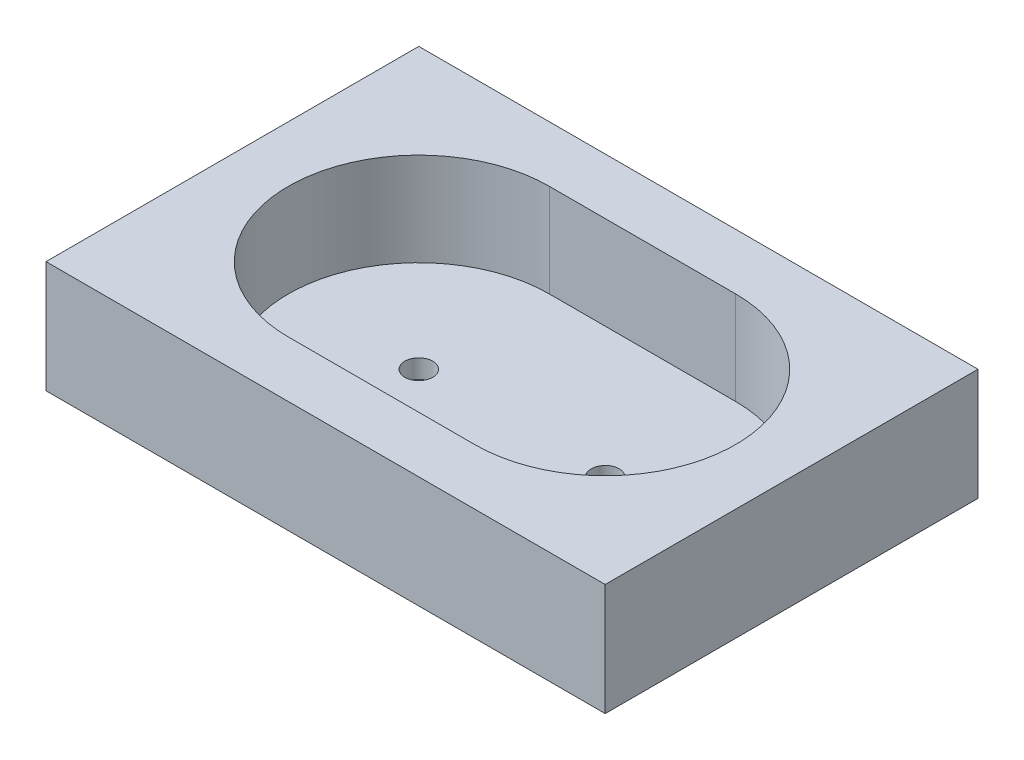
ISO-10303-21;
HEADER;
FILE_DESCRIPTION(('STEP AP214'),'2;1');
FILE_NAME('part.step','',(''),(''),'','','');
FILE_SCHEMA(('AUTOMOTIVE_DESIGN { 1 0 10303 214 1 1 1 1 }'));
ENDSEC;
DATA;
#1=APPLICATION_CONTEXT('core data for automotive mechanical design processes');
#2=APPLICATION_PROTOCOL_DEFINITION('international standard','automotive_design',2000,#1);
#3=PRODUCT_CONTEXT('',#1,'mechanical');
#4=PRODUCT('Part','Part','',(#3));
#5=PRODUCT_RELATED_PRODUCT_CATEGORY('part','',(#4));
#6=PRODUCT_DEFINITION_FORMATION('','',#4);
#7=PRODUCT_DEFINITION_CONTEXT('part definition',#1,'design');
#8=PRODUCT_DEFINITION('design','',#6,#7);
#9=PRODUCT_DEFINITION_SHAPE('','',#8);
#10=(LENGTH_UNIT() NAMED_UNIT(*) SI_UNIT(.MILLI.,.METRE.));
#11=(NAMED_UNIT(*) PLANE_ANGLE_UNIT() SI_UNIT($,.RADIAN.));
#12=(NAMED_UNIT(*) SI_UNIT($,.STERADIAN.) SOLID_ANGLE_UNIT());
#13=UNCERTAINTY_MEASURE_WITH_UNIT(LENGTH_MEASURE(1.E-05),#10,'distance_accuracy_value','');
#14=(GEOMETRIC_REPRESENTATION_CONTEXT(3) GLOBAL_UNCERTAINTY_ASSIGNED_CONTEXT((#13)) GLOBAL_UNIT_ASSIGNED_CONTEXT((#10,
#11,#12)) REPRESENTATION_CONTEXT('',''));
#15=CARTESIAN_POINT('',(0.,0.,0.));
#16=DIRECTION('',(0.,0.,1.));
#17=DIRECTION('',(1.,0.,0.));
#18=AXIS2_PLACEMENT_3D('',#15,#16,#17);
#19=CARTESIAN_POINT('',(20.,10.,0.));
#20=DIRECTION('',(1.,0.,0.));
#21=DIRECTION('',(0.,0.,-1.));
#22=AXIS2_PLACEMENT_3D('',#19,#20,#21);
#23=PLANE('',#22);
#24=DIRECTION('',(0.,-1.,0.));
#25=VECTOR('',#24,1.);
#26=CARTESIAN_POINT('',(20.,10.,20.));
#27=LINE('',#26,#25);
#28=CARTESIAN_POINT('',(20.,10.,20.));
#29=VERTEX_POINT('',#28);
#30=CARTESIAN_POINT('',(20.,-2.,20.));
#31=VERTEX_POINT('',#30);
#32=EDGE_CURVE('E119',#29,#31,#27,.T.);
#33=ORIENTED_EDGE('',*,*,#32,.T.);
#34=DIRECTION('',(0.,0.,1.));
#35=VECTOR('',#34,1.);
#36=CARTESIAN_POINT('',(20.,-2.,0.));
#37=LINE('',#36,#35);
#38=CARTESIAN_POINT('',(20.,-2.,-20.));
#39=VERTEX_POINT('',#38);
#40=EDGE_CURVE('E114',#39,#31,#37,.T.);
#41=ORIENTED_EDGE('',*,*,#40,.F.);
#42=DIRECTION('',(0.,-1.,0.));
#43=VECTOR('',#42,1.);
#44=CARTESIAN_POINT('',(20.,10.,-20.));
#45=LINE('',#44,#43);
#46=CARTESIAN_POINT('',(20.,10.,-20.));
#47=VERTEX_POINT('',#46);
#48=EDGE_CURVE('E11',#47,#39,#45,.T.);
#49=ORIENTED_EDGE('',*,*,#48,.F.);
#50=DIRECTION('',(0.,0.,1.));
#51=VECTOR('',#50,1.);
#52=CARTESIAN_POINT('',(20.,10.,0.));
#53=LINE('',#52,#51);
#54=EDGE_CURVE('E150',#47,#29,#53,.T.);
#55=ORIENTED_EDGE('',*,*,#54,.T.);
#56=EDGE_LOOP('',(#33,#41,#49,#55));
#57=FACE_BOUND('',#56,.T.);
#58=ADVANCED_FACE('F38',(#57),#23,.T.);
#59=CARTESIAN_POINT('',(0.,10.,-20.));
#60=DIRECTION('',(0.,0.,-1.));
#61=DIRECTION('',(-1.,0.,0.));
#62=AXIS2_PLACEMENT_3D('',#59,#60,#61);
#63=PLANE('',#62);
#64=ORIENTED_EDGE('',*,*,#48,.T.);
#65=DIRECTION('',(1.,0.,0.));
#66=VECTOR('',#65,1.);
#67=CARTESIAN_POINT('',(0.,-2.,-20.));
#68=LINE('',#67,#66);
#69=CARTESIAN_POINT('',(-40.,-2.,-20.));
#70=VERTEX_POINT('',#69);
#71=EDGE_CURVE('E102',#70,#39,#68,.T.);
#72=ORIENTED_EDGE('',*,*,#71,.F.);
#73=DIRECTION('',(0.,-1.,0.));
#74=VECTOR('',#73,1.);
#75=CARTESIAN_POINT('',(-40.,10.,-20.));
#76=LINE('',#75,#74);
#77=CARTESIAN_POINT('',(-40.,10.,-20.));
#78=VERTEX_POINT('',#77);
#79=EDGE_CURVE('E48',#78,#70,#76,.T.);
#80=ORIENTED_EDGE('',*,*,#79,.F.);
#81=DIRECTION('',(1.,0.,0.));
#82=VECTOR('',#81,1.);
#83=CARTESIAN_POINT('',(0.,10.,-20.));
#84=LINE('',#83,#82);
#85=EDGE_CURVE('E105',#78,#47,#84,.T.);
#86=ORIENTED_EDGE('',*,*,#85,.T.);
#87=EDGE_LOOP('',(#64,#72,#80,#86));
#88=FACE_BOUND('',#87,.T.);
#89=ADVANCED_FACE('F101',(#88),#63,.T.);
#90=CARTESIAN_POINT('',(-40.,10.,0.));
#91=DIRECTION('',(1.,0.,0.));
#92=DIRECTION('',(0.,0.,-1.));
#93=AXIS2_PLACEMENT_3D('',#90,#91,#92);
#94=PLANE('',#93);
#95=ORIENTED_EDGE('',*,*,#79,.T.);
#96=DIRECTION('',(0.,0.,1.));
#97=VECTOR('',#96,1.);
#98=CARTESIAN_POINT('',(-40.,-2.,0.));
#99=LINE('',#98,#97);
#100=CARTESIAN_POINT('',(-40.,-2.,20.));
#101=VERTEX_POINT('',#100);
#102=EDGE_CURVE('E117',#70,#101,#99,.T.);
#103=ORIENTED_EDGE('',*,*,#102,.T.);
#104=DIRECTION('',(0.,-1.,0.));
#105=VECTOR('',#104,1.);
#106=CARTESIAN_POINT('',(-40.,10.,20.));
#107=LINE('',#106,#105);
#108=CARTESIAN_POINT('',(-40.,10.,20.));
#109=VERTEX_POINT('',#108);
#110=EDGE_CURVE('E166',#109,#101,#107,.T.);
#111=ORIENTED_EDGE('',*,*,#110,.F.);
#112=DIRECTION('',(0.,0.,1.));
#113=VECTOR('',#112,1.);
#114=CARTESIAN_POINT('',(-40.,10.,0.));
#115=LINE('',#114,#113);
#116=EDGE_CURVE('E153',#78,#109,#115,.T.);
#117=ORIENTED_EDGE('',*,*,#116,.F.);
#118=EDGE_LOOP('',(#95,#103,#111,#117));
#119=FACE_BOUND('',#118,.T.);
#120=ADVANCED_FACE('F211',(#119),#94,.F.);
#121=CARTESIAN_POINT('',(-20.,10.,0.));
#122=DIRECTION('',(0.,-1.,0.));
#123=DIRECTION('',(0.,0.,-1.));
#124=AXIS2_PLACEMENT_3D('',#121,#122,#123);
#125=CYLINDRICAL_SURFACE('',#124,14.);
#126=CARTESIAN_POINT('',(-20.,0.,0.));
#127=DIRECTION('',(0.,1.,0.));
#128=DIRECTION('',(0.,0.,1.));
#129=AXIS2_PLACEMENT_3D('',#126,#127,#128);
#130=CIRCLE('',#129,14.);
#131=CARTESIAN_POINT('',(-20.,0.,-14.));
#132=VERTEX_POINT('',#131);
#133=CARTESIAN_POINT('',(-20.,0.,14.));
#134=VERTEX_POINT('',#133);
#135=EDGE_CURVE('E135',#132,#134,#130,.T.);
#136=ORIENTED_EDGE('',*,*,#135,.F.);
#137=DIRECTION('',(0.,-1.,0.));
#138=VECTOR('',#137,1.);
#139=CARTESIAN_POINT('',(-20.,10.,-14.));
#140=LINE('',#139,#138);
#141=CARTESIAN_POINT('',(-20.,10.,-14.));
#142=VERTEX_POINT('',#141);
#143=EDGE_CURVE('E42',#142,#132,#140,.T.);
#144=ORIENTED_EDGE('',*,*,#143,.F.);
#145=CARTESIAN_POINT('',(-20.,10.,0.));
#146=DIRECTION('',(0.,1.,0.));
#147=DIRECTION('',(0.,0.,1.));
#148=AXIS2_PLACEMENT_3D('',#145,#146,#147);
#149=CIRCLE('',#148,14.);
#150=CARTESIAN_POINT('',(-20.,10.,14.));
#151=VERTEX_POINT('',#150);
#152=EDGE_CURVE('E138',#142,#151,#149,.T.);
#153=ORIENTED_EDGE('',*,*,#152,.T.);
#154=DIRECTION('',(0.,-1.,0.));
#155=VECTOR('',#154,1.);
#156=CARTESIAN_POINT('',(-20.,10.,14.));
#157=LINE('',#156,#155);
#158=EDGE_CURVE('E156',#151,#134,#157,.T.);
#159=ORIENTED_EDGE('',*,*,#158,.T.);
#160=EDGE_LOOP('',(#136,#144,#153,#159));
#161=FACE_BOUND('',#160,.T.);
#162=ADVANCED_FACE('F40',(#161),#125,.F.);
#163=CARTESIAN_POINT('',(0.,10.,-14.));
#164=DIRECTION('',(0.,0.,-1.));
#165=DIRECTION('',(-1.,0.,0.));
#166=AXIS2_PLACEMENT_3D('',#163,#164,#165);
#167=PLANE('',#166);
#168=DIRECTION('',(1.,0.,0.));
#169=VECTOR('',#168,1.);
#170=CARTESIAN_POINT('',(0.,0.,-14.));
#171=LINE('',#170,#169);
#172=CARTESIAN_POINT('',(0.,0.,-14.));
#173=VERTEX_POINT('',#172);
#174=EDGE_CURVE('E158',#132,#173,#171,.T.);
#175=ORIENTED_EDGE('',*,*,#174,.T.);
#176=DIRECTION('',(0.,-1.,0.));
#177=VECTOR('',#176,1.);
#178=CARTESIAN_POINT('',(0.,10.,-14.));
#179=LINE('',#178,#177);
#180=CARTESIAN_POINT('',(0.,10.,-14.));
#181=VERTEX_POINT('',#180);
#182=EDGE_CURVE('E173',#181,#173,#179,.T.);
#183=ORIENTED_EDGE('',*,*,#182,.F.);
#184=DIRECTION('',(1.,0.,0.));
#185=VECTOR('',#184,1.);
#186=CARTESIAN_POINT('',(0.,10.,-14.));
#187=LINE('',#186,#185);
#188=EDGE_CURVE('E141',#142,#181,#187,.T.);
#189=ORIENTED_EDGE('',*,*,#188,.F.);
#190=ORIENTED_EDGE('',*,*,#143,.T.);
#191=EDGE_LOOP('',(#175,#183,#189,#190));
#192=FACE_BOUND('',#191,.T.);
#193=ADVANCED_FACE('F182',(#192),#167,.F.);
#194=CARTESIAN_POINT('',(0.,10.,0.));
#195=DIRECTION('',(0.,-1.,0.));
#196=DIRECTION('',(0.,0.,-1.));
#197=AXIS2_PLACEMENT_3D('',#194,#195,#196);
#198=CYLINDRICAL_SURFACE('',#197,14.);
#199=CARTESIAN_POINT('',(0.,0.,0.));
#200=DIRECTION('',(0.,1.,0.));
#201=DIRECTION('',(0.,0.,1.));
#202=AXIS2_PLACEMENT_3D('',#199,#200,#201);
#203=CIRCLE('',#202,14.);
#204=CARTESIAN_POINT('',(0.,0.,14.));
#205=VERTEX_POINT('',#204);
#206=EDGE_CURVE('E161',#205,#173,#203,.T.);
#207=ORIENTED_EDGE('',*,*,#206,.F.);
#208=DIRECTION('',(0.,-1.,0.));
#209=VECTOR('',#208,1.);
#210=CARTESIAN_POINT('',(0.,10.,14.));
#211=LINE('',#210,#209);
#212=CARTESIAN_POINT('',(0.,10.,14.));
#213=VERTEX_POINT('',#212);
#214=EDGE_CURVE('E171',#213,#205,#211,.T.);
#215=ORIENTED_EDGE('',*,*,#214,.F.);
#216=CARTESIAN_POINT('',(0.,10.,0.));
#217=DIRECTION('',(0.,1.,0.));
#218=DIRECTION('',(0.,0.,1.));
#219=AXIS2_PLACEMENT_3D('',#216,#217,#218);
#220=CIRCLE('',#219,14.);
#221=EDGE_CURVE('E144',#213,#181,#220,.T.);
#222=ORIENTED_EDGE('',*,*,#221,.T.);
#223=ORIENTED_EDGE('',*,*,#182,.T.);
#224=EDGE_LOOP('',(#207,#215,#222,#223));
#225=FACE_BOUND('',#224,.T.);
#226=ADVANCED_FACE('F189',(#225),#198,.F.);
#227=CARTESIAN_POINT('',(0.,10.,14.));
#228=DIRECTION('',(0.,0.,-1.));
#229=DIRECTION('',(-1.,0.,0.));
#230=AXIS2_PLACEMENT_3D('',#227,#228,#229);
#231=PLANE('',#230);
#232=DIRECTION('',(1.,0.,0.));
#233=VECTOR('',#232,1.);
#234=CARTESIAN_POINT('',(0.,0.,14.));
#235=LINE('',#234,#233);
#236=EDGE_CURVE('E142',#134,#205,#235,.T.);
#237=ORIENTED_EDGE('',*,*,#236,.F.);
#238=ORIENTED_EDGE('',*,*,#158,.F.);
#239=DIRECTION('',(1.,0.,0.));
#240=VECTOR('',#239,1.);
#241=CARTESIAN_POINT('',(0.,10.,14.));
#242=LINE('',#241,#240);
#243=EDGE_CURVE('E147',#151,#213,#242,.T.);
#244=ORIENTED_EDGE('',*,*,#243,.T.);
#245=ORIENTED_EDGE('',*,*,#214,.T.);
#246=EDGE_LOOP('',(#237,#238,#244,#245));
#247=FACE_BOUND('',#246,.T.);
#248=ADVANCED_FACE('F195',(#247),#231,.T.);
#249=CARTESIAN_POINT('',(0.,10.,20.));
#250=DIRECTION('',(0.,0.,-1.));
#251=DIRECTION('',(-1.,0.,0.));
#252=AXIS2_PLACEMENT_3D('',#249,#250,#251);
#253=PLANE('',#252);
#254=ORIENTED_EDGE('',*,*,#110,.T.);
#255=DIRECTION('',(1.,0.,0.));
#256=VECTOR('',#255,1.);
#257=CARTESIAN_POINT('',(0.,-2.,20.));
#258=LINE('',#257,#256);
#259=EDGE_CURVE('E127',#101,#31,#258,.T.);
#260=ORIENTED_EDGE('',*,*,#259,.T.);
#261=ORIENTED_EDGE('',*,*,#32,.F.);
#262=DIRECTION('',(1.,0.,0.));
#263=VECTOR('',#262,1.);
#264=CARTESIAN_POINT('',(0.,10.,20.));
#265=LINE('',#264,#263);
#266=EDGE_CURVE('E56',#109,#29,#265,.T.);
#267=ORIENTED_EDGE('',*,*,#266,.F.);
#268=EDGE_LOOP('',(#254,#260,#261,#267));
#269=FACE_BOUND('',#268,.T.);
#270=ADVANCED_FACE('F197',(#269),#253,.F.);
#271=CARTESIAN_POINT('',(0.,10.,0.));
#272=DIRECTION('',(0.,1.,0.));
#273=DIRECTION('',(0.,0.,1.));
#274=AXIS2_PLACEMENT_3D('',#271,#272,#273);
#275=PLANE('',#274);
#276=ORIENTED_EDGE('',*,*,#152,.F.);
#277=ORIENTED_EDGE('',*,*,#188,.T.);
#278=ORIENTED_EDGE('',*,*,#221,.F.);
#279=ORIENTED_EDGE('',*,*,#243,.F.);
#280=EDGE_LOOP('',(#276,#277,#278,#279));
#281=FACE_BOUND('',#280,.T.);
#282=ORIENTED_EDGE('',*,*,#54,.F.);
#283=ORIENTED_EDGE('',*,*,#85,.F.);
#284=ORIENTED_EDGE('',*,*,#116,.T.);
#285=ORIENTED_EDGE('',*,*,#266,.T.);
#286=EDGE_LOOP('',(#282,#283,#284,#285));
#287=FACE_BOUND('',#286,.T.);
#288=ADVANCED_FACE('F194',(#281,#287),#275,.T.);
#289=CARTESIAN_POINT('',(-20.,-2.,0.));
#290=DIRECTION('',(0.,1.,0.));
#291=DIRECTION('',(0.,0.,1.));
#292=AXIS2_PLACEMENT_3D('',#289,#290,#291);
#293=CYLINDRICAL_SURFACE('',#292,1.5);
#294=CARTESIAN_POINT('',(-20.,-2.,0.));
#295=DIRECTION('',(0.,1.,0.));
#296=DIRECTION('',(0.,0.,1.));
#297=AXIS2_PLACEMENT_3D('',#294,#295,#296);
#298=CIRCLE('',#297,1.5);
#299=CARTESIAN_POINT('',(-20.,-2.,1.5));
#300=VERTEX_POINT('',#299);
#301=EDGE_CURVE('E129',#300,#300,#298,.T.);
#302=ORIENTED_EDGE('',*,*,#301,.F.);
#303=EDGE_LOOP('',(#302));
#304=FACE_BOUND('',#303,.T.);
#305=CARTESIAN_POINT('',(-20.,0.,0.));
#306=DIRECTION('',(0.,1.,0.));
#307=DIRECTION('',(0.,0.,1.));
#308=AXIS2_PLACEMENT_3D('',#305,#306,#307);
#309=CIRCLE('',#308,1.5);
#310=CARTESIAN_POINT('',(-20.,0.,1.5));
#311=VERTEX_POINT('',#310);
#312=EDGE_CURVE('E123',#311,#311,#309,.T.);
#313=ORIENTED_EDGE('',*,*,#312,.T.);
#314=EDGE_LOOP('',(#313));
#315=FACE_BOUND('',#314,.T.);
#316=ADVANCED_FACE('F219',(#304,#315),#293,.F.);
#317=CARTESIAN_POINT('',(0.,-2.,0.));
#318=DIRECTION('',(0.,1.,0.));
#319=DIRECTION('',(0.,0.,1.));
#320=AXIS2_PLACEMENT_3D('',#317,#318,#319);
#321=CYLINDRICAL_SURFACE('',#320,1.5);
#322=CARTESIAN_POINT('',(0.,-2.,0.));
#323=DIRECTION('',(0.,1.,0.));
#324=DIRECTION('',(0.,0.,1.));
#325=AXIS2_PLACEMENT_3D('',#322,#323,#324);
#326=CIRCLE('',#325,1.5);
#327=CARTESIAN_POINT('',(0.,-2.,1.5));
#328=VERTEX_POINT('',#327);
#329=EDGE_CURVE('E132',#328,#328,#326,.T.);
#330=ORIENTED_EDGE('',*,*,#329,.F.);
#331=EDGE_LOOP('',(#330));
#332=FACE_BOUND('',#331,.T.);
#333=CARTESIAN_POINT('',(0.,0.,0.));
#334=DIRECTION('',(0.,1.,0.));
#335=DIRECTION('',(0.,0.,1.));
#336=AXIS2_PLACEMENT_3D('',#333,#334,#335);
#337=CIRCLE('',#336,1.5);
#338=CARTESIAN_POINT('',(0.,0.,1.5));
#339=VERTEX_POINT('',#338);
#340=EDGE_CURVE('E120',#339,#339,#337,.T.);
#341=ORIENTED_EDGE('',*,*,#340,.T.);
#342=EDGE_LOOP('',(#341));
#343=FACE_BOUND('',#342,.T.);
#344=ADVANCED_FACE('F222',(#332,#343),#321,.F.);
#345=CARTESIAN_POINT('',(0.,-2.,0.));
#346=DIRECTION('',(0.,1.,0.));
#347=DIRECTION('',(0.,0.,1.));
#348=AXIS2_PLACEMENT_3D('',#345,#346,#347);
#349=PLANE('',#348);
#350=ORIENTED_EDGE('',*,*,#40,.T.);
#351=ORIENTED_EDGE('',*,*,#259,.F.);
#352=ORIENTED_EDGE('',*,*,#102,.F.);
#353=ORIENTED_EDGE('',*,*,#71,.T.);
#354=EDGE_LOOP('',(#350,#351,#352,#353));
#355=FACE_BOUND('',#354,.T.);
#356=ORIENTED_EDGE('',*,*,#301,.T.);
#357=EDGE_LOOP('',(#356));
#358=FACE_BOUND('',#357,.T.);
#359=ORIENTED_EDGE('',*,*,#329,.T.);
#360=EDGE_LOOP('',(#359));
#361=FACE_BOUND('',#360,.T.);
#362=ADVANCED_FACE('F111',(#355,#358,#361),#349,.F.);
#363=CARTESIAN_POINT('',(0.,0.,0.));
#364=DIRECTION('',(0.,1.,0.));
#365=DIRECTION('',(0.,0.,1.));
#366=AXIS2_PLACEMENT_3D('',#363,#364,#365);
#367=PLANE('',#366);
#368=ORIENTED_EDGE('',*,*,#174,.F.);
#369=ORIENTED_EDGE('',*,*,#135,.T.);
#370=ORIENTED_EDGE('',*,*,#236,.T.);
#371=ORIENTED_EDGE('',*,*,#206,.T.);
#372=EDGE_LOOP('',(#368,#369,#370,#371));
#373=FACE_BOUND('',#372,.T.);
#374=ORIENTED_EDGE('',*,*,#312,.F.);
#375=EDGE_LOOP('',(#374));
#376=FACE_BOUND('',#375,.T.);
#377=ORIENTED_EDGE('',*,*,#340,.F.);
#378=EDGE_LOOP('',(#377));
#379=FACE_BOUND('',#378,.T.);
#380=ADVANCED_FACE('F187',(#373,#376,#379),#367,.T.);
#381=CLOSED_SHELL('',(#58,#89,#120,#162,#193,#226,#248,#270,#288,#316,#344,#362,#380));
#382=MANIFOLD_SOLID_BREP('B2',#381);
#383=ADVANCED_BREP_SHAPE_REPRESENTATION('',(#18,#382),#14);
#384=SHAPE_DEFINITION_REPRESENTATION(#9,#383);
ENDSEC;
END-ISO-10303-21;
